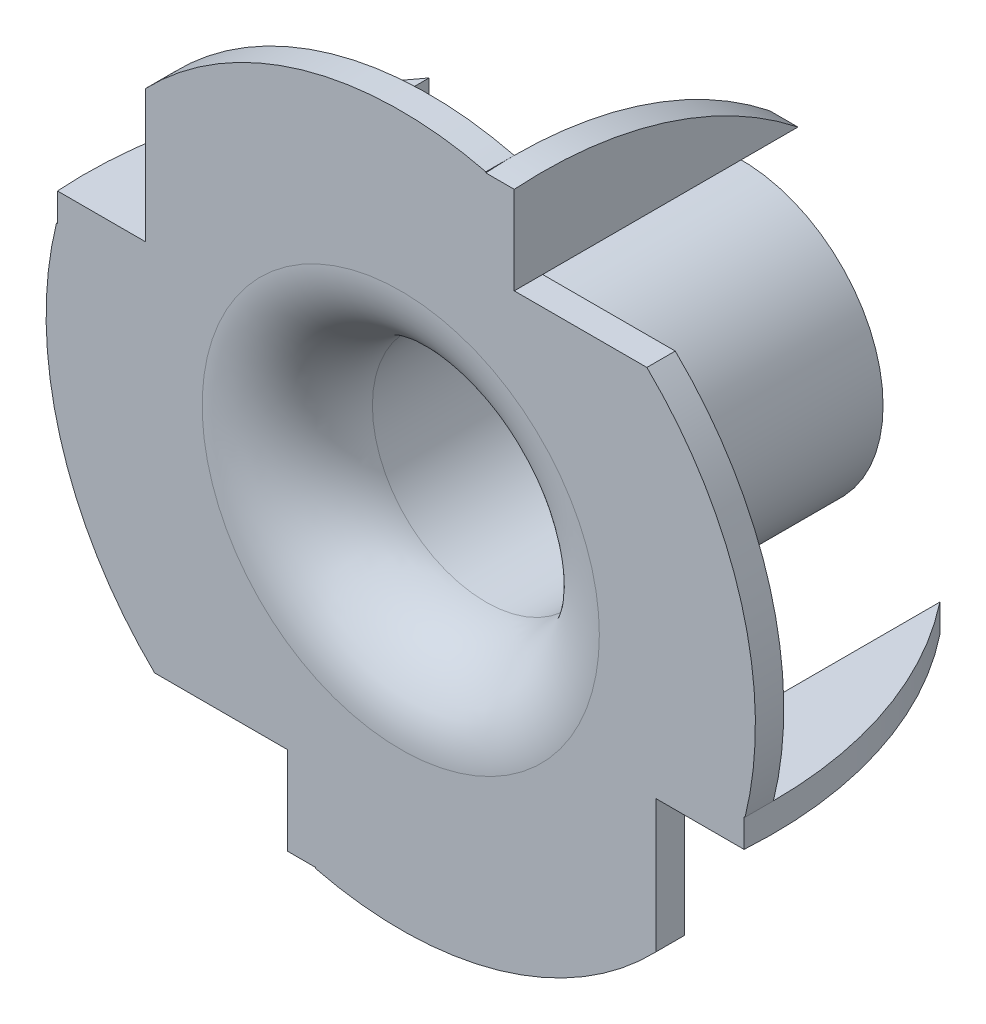
ISO-10303-21;
HEADER;
FILE_DESCRIPTION(('STEP AP214'),'2;1');
FILE_NAME('part.step','',(''),(''),'','','');
FILE_SCHEMA(('AUTOMOTIVE_DESIGN { 1 0 10303 214 1 1 1 1 }'));
ENDSEC;
DATA;
#1=APPLICATION_CONTEXT('core data for automotive mechanical design processes');
#2=APPLICATION_PROTOCOL_DEFINITION('international standard','automotive_design',2000,#1);
#3=PRODUCT_CONTEXT('',#1,'mechanical');
#4=PRODUCT('Part','Part','',(#3));
#5=PRODUCT_RELATED_PRODUCT_CATEGORY('part','',(#4));
#6=PRODUCT_DEFINITION_FORMATION('','',#4);
#7=PRODUCT_DEFINITION_CONTEXT('part definition',#1,'design');
#8=PRODUCT_DEFINITION('design','',#6,#7);
#9=PRODUCT_DEFINITION_SHAPE('','',#8);
#10=(LENGTH_UNIT() NAMED_UNIT(*) SI_UNIT(.MILLI.,.METRE.));
#11=(NAMED_UNIT(*) PLANE_ANGLE_UNIT() SI_UNIT($,.RADIAN.));
#12=(NAMED_UNIT(*) SI_UNIT($,.STERADIAN.) SOLID_ANGLE_UNIT());
#13=UNCERTAINTY_MEASURE_WITH_UNIT(LENGTH_MEASURE(1.E-05),#10,'distance_accuracy_value','');
#14=(GEOMETRIC_REPRESENTATION_CONTEXT(3) GLOBAL_UNCERTAINTY_ASSIGNED_CONTEXT((#13)) GLOBAL_UNIT_ASSIGNED_CONTEXT((#10,
#11,#12)) REPRESENTATION_CONTEXT('',''));
#15=CARTESIAN_POINT('',(0.,0.,0.));
#16=DIRECTION('',(0.,0.,1.));
#17=DIRECTION('',(1.,0.,0.));
#18=AXIS2_PLACEMENT_3D('',#15,#16,#17);
#19=CARTESIAN_POINT('',(15.5,8.99999999999986,0.5));
#20=DIRECTION('',(-1.,0.,0.));
#21=DIRECTION('',(0.,-1.,0.));
#22=AXIS2_PLACEMENT_3D('',#19,#20,#21);
#23=PLANE('',#22);
#24=CARTESIAN_POINT('',(15.5,-2.35272642428521,-0.500000000000002));
#25=DIRECTION('',(1.,0.,0.));
#26=DIRECTION('',(0.,0.,1.));
#27=AXIS2_PLACEMENT_3D('',#24,#25,#26);
#28=CIRCLE('',#27,14.4873875237968);
#29=CARTESIAN_POINT('',(15.4999999999999,12.1346610995116,-0.5));
#30=VERTEX_POINT('',#29);
#31=CARTESIAN_POINT('',(15.4999999999999,12.1001071132833,0.5));
#32=VERTEX_POINT('',#31);
#33=EDGE_CURVE('E420',#30,#32,#28,.T.);
#34=ORIENTED_EDGE('',*,*,#33,.F.);
#35=DIRECTION('',(0.,0.,-1.));
#36=VECTOR('',#35,1.);
#37=CARTESIAN_POINT('',(15.5,12.1346610995115,0.5));
#38=LINE('',#37,#36);
#39=CARTESIAN_POINT('',(15.5,12.1346610995115,0.5));
#40=VERTEX_POINT('',#39);
#41=EDGE_CURVE('E274',#40,#30,#38,.T.);
#42=ORIENTED_EDGE('',*,*,#41,.F.);
#43=DIRECTION('',(0.,1.,0.));
#44=VECTOR('',#43,1.);
#45=CARTESIAN_POINT('',(15.5,8.99999999999986,0.5));
#46=LINE('',#45,#44);
#47=EDGE_CURVE('E309',#32,#40,#46,.T.);
#48=ORIENTED_EDGE('',*,*,#47,.F.);
#49=EDGE_LOOP('',(#34,#42,#48));
#50=FACE_BOUND('',#49,.T.);
#51=ADVANCED_FACE('F42',(#50),#23,.F.);
#52=CARTESIAN_POINT('',(21.4999999999999,-3.00000000000019,0.5));
#53=DIRECTION('',(0.,1.,0.));
#54=DIRECTION('',(-1.,0.,0.));
#55=AXIS2_PLACEMENT_3D('',#52,#53,#54);
#56=PLANE('',#55);
#57=CARTESIAN_POINT('',(10.1472735757148,-3.,-0.500000000000002));
#58=DIRECTION('',(0.,-1.,0.));
#59=DIRECTION('',(0.,0.,1.));
#60=AXIS2_PLACEMENT_3D('',#57,#58,#59);
#61=CIRCLE('',#60,14.4873875237968);
#62=CARTESIAN_POINT('',(24.6346610995116,-3.,-0.5));
#63=VERTEX_POINT('',#62);
#64=CARTESIAN_POINT('',(24.6001071132832,-3.,0.5));
#65=VERTEX_POINT('',#64);
#66=EDGE_CURVE('E214',#63,#65,#61,.T.);
#67=ORIENTED_EDGE('',*,*,#66,.F.);
#68=DIRECTION('',(0.,0.,-1.));
#69=VECTOR('',#68,1.);
#70=CARTESIAN_POINT('',(24.6346610995115,-3.00000000000017,0.5));
#71=LINE('',#70,#69);
#72=CARTESIAN_POINT('',(24.6346610995115,-3.00000000000017,0.5));
#73=VERTEX_POINT('',#72);
#74=EDGE_CURVE('E300',#73,#63,#71,.T.);
#75=ORIENTED_EDGE('',*,*,#74,.F.);
#76=DIRECTION('',(1.,0.,0.));
#77=VECTOR('',#76,1.);
#78=CARTESIAN_POINT('',(21.4999999999999,-3.00000000000019,0.5));
#79=LINE('',#78,#77);
#80=EDGE_CURVE('E299',#65,#73,#79,.T.);
#81=ORIENTED_EDGE('',*,*,#80,.F.);
#82=EDGE_LOOP('',(#67,#75,#81));
#83=FACE_BOUND('',#82,.T.);
#84=ADVANCED_FACE('F425',(#83),#56,.F.);
#85=CARTESIAN_POINT('',(9.49999999999986,-9.0000000000001,0.5));
#86=DIRECTION('',(1.,0.,0.));
#87=DIRECTION('',(0.,1.,0.));
#88=AXIS2_PLACEMENT_3D('',#85,#86,#87);
#89=PLANE('',#88);
#90=CARTESIAN_POINT('',(9.49999999999999,2.35272642428523,-0.500000000000002));
#91=DIRECTION('',(-1.,0.,0.));
#92=DIRECTION('',(0.,0.,1.));
#93=AXIS2_PLACEMENT_3D('',#90,#91,#92);
#94=CIRCLE('',#93,14.4873875237968);
#95=CARTESIAN_POINT('',(9.50000000000004,-12.1346610995116,-0.5));
#96=VERTEX_POINT('',#95);
#97=CARTESIAN_POINT('',(9.50000000000004,-12.1001071132833,0.5));
#98=VERTEX_POINT('',#97);
#99=EDGE_CURVE('E245',#96,#98,#94,.T.);
#100=ORIENTED_EDGE('',*,*,#99,.F.);
#101=DIRECTION('',(0.,0.,-1.));
#102=VECTOR('',#101,1.);
#103=CARTESIAN_POINT('',(9.49999999999987,-12.1346610995117,0.5));
#104=LINE('',#103,#102);
#105=CARTESIAN_POINT('',(9.49999999999987,-12.1346610995117,0.5));
#106=VERTEX_POINT('',#105);
#107=EDGE_CURVE('E290',#106,#96,#104,.T.);
#108=ORIENTED_EDGE('',*,*,#107,.F.);
#109=DIRECTION('',(0.,-1.,0.));
#110=VECTOR('',#109,1.);
#111=CARTESIAN_POINT('',(9.49999999999986,-9.0000000000001,0.5));
#112=LINE('',#111,#110);
#113=EDGE_CURVE('E289',#98,#106,#112,.T.);
#114=ORIENTED_EDGE('',*,*,#113,.F.);
#115=EDGE_LOOP('',(#100,#108,#114));
#116=FACE_BOUND('',#115,.T.);
#117=ADVANCED_FACE('F430',(#116),#89,.F.);
#118=CARTESIAN_POINT('',(3.5,3.,0.5));
#119=DIRECTION('',(0.,-1.,0.));
#120=DIRECTION('',(0.,0.,-1.));
#121=AXIS2_PLACEMENT_3D('',#118,#119,#120);
#122=PLANE('',#121);
#123=CARTESIAN_POINT('',(14.8527264242852,3.,-0.500000000000002));
#124=DIRECTION('',(0.,1.,0.));
#125=DIRECTION('',(0.,0.,1.));
#126=AXIS2_PLACEMENT_3D('',#123,#124,#125);
#127=CIRCLE('',#126,14.4873875237968);
#128=CARTESIAN_POINT('',(0.365338900488402,3.,-0.5));
#129=VERTEX_POINT('',#128);
#130=CARTESIAN_POINT('',(0.399892886716758,3.,0.5));
#131=VERTEX_POINT('',#130);
#132=EDGE_CURVE('E265',#129,#131,#127,.T.);
#133=ORIENTED_EDGE('',*,*,#132,.F.);
#134=DIRECTION('',(0.,0.,-1.));
#135=VECTOR('',#134,1.);
#136=CARTESIAN_POINT('',(0.365338900488402,3.,0.5));
#137=LINE('',#136,#135);
#138=CARTESIAN_POINT('',(0.365338900488402,3.,0.5));
#139=VERTEX_POINT('',#138);
#140=EDGE_CURVE('E282',#139,#129,#137,.T.);
#141=ORIENTED_EDGE('',*,*,#140,.F.);
#142=DIRECTION('',(-1.,0.,0.));
#143=VECTOR('',#142,1.);
#144=CARTESIAN_POINT('',(3.5,3.,0.5));
#145=LINE('',#144,#143);
#146=EDGE_CURVE('E278',#131,#139,#145,.T.);
#147=ORIENTED_EDGE('',*,*,#146,.F.);
#148=EDGE_LOOP('',(#133,#141,#147));
#149=FACE_BOUND('',#148,.T.);
#150=ADVANCED_FACE('F527',(#149),#122,.F.);
#151=CARTESIAN_POINT('',(12.5,0.,0.));
#152=DIRECTION('',(0.,0.,1.));
#153=DIRECTION('',(1.,0.,0.));
#154=AXIS2_PLACEMENT_3D('',#151,#152,#153);
#155=CYLINDRICAL_SURFACE('',#154,12.5);
#156=ORIENTED_EDGE('',*,*,#140,.T.);
#157=CARTESIAN_POINT('',(12.5,0.,-0.5));
#158=DIRECTION('',(0.,0.,1.));
#159=DIRECTION('',(1.,0.,0.));
#160=AXIS2_PLACEMENT_3D('',#157,#158,#159);
#161=CIRCLE('',#160,12.5);
#162=CARTESIAN_POINT('',(3.82532421355138,-9.00000000000012,-0.5));
#163=VERTEX_POINT('',#162);
#164=EDGE_CURVE('E379',#129,#163,#161,.T.);
#165=ORIENTED_EDGE('',*,*,#164,.T.);
#166=DIRECTION('',(0.,0.,-1.));
#167=VECTOR('',#166,1.);
#168=CARTESIAN_POINT('',(3.82532421355112,-9.00000000000012,0.5));
#169=LINE('',#168,#167);
#170=CARTESIAN_POINT('',(3.82532421355112,-9.00000000000012,0.5));
#171=VERTEX_POINT('',#170);
#172=EDGE_CURVE('E287',#171,#163,#169,.T.);
#173=ORIENTED_EDGE('',*,*,#172,.F.);
#174=CARTESIAN_POINT('',(12.5,0.,0.5));
#175=DIRECTION('',(0.,0.,1.));
#176=DIRECTION('',(1.,0.,0.));
#177=AXIS2_PLACEMENT_3D('',#174,#175,#176);
#178=CIRCLE('',#177,12.5);
#179=EDGE_CURVE('E402',#139,#171,#178,.T.);
#180=ORIENTED_EDGE('',*,*,#179,.F.);
#181=EDGE_LOOP('',(#156,#165,#173,#180));
#182=FACE_BOUND('',#181,.T.);
#183=ADVANCED_FACE('F456',(#182),#155,.T.);
#184=ORIENTED_EDGE('',*,*,#107,.T.);
#185=CARTESIAN_POINT('',(21.5,-8.67467578644876,-0.5));
#186=VERTEX_POINT('',#185);
#187=EDGE_CURVE('E337',#96,#186,#161,.T.);
#188=ORIENTED_EDGE('',*,*,#187,.T.);
#189=DIRECTION('',(0.,0.,-1.));
#190=VECTOR('',#189,1.);
#191=CARTESIAN_POINT('',(21.5,-8.67467578644893,0.5));
#192=LINE('',#191,#190);
#193=CARTESIAN_POINT('',(21.5,-8.67467578644893,0.5));
#194=VERTEX_POINT('',#193);
#195=EDGE_CURVE('E297',#194,#186,#192,.T.);
#196=ORIENTED_EDGE('',*,*,#195,.F.);
#197=EDGE_CURVE('E332',#106,#194,#178,.T.);
#198=ORIENTED_EDGE('',*,*,#197,.F.);
#199=EDGE_LOOP('',(#184,#188,#196,#198));
#200=FACE_BOUND('',#199,.T.);
#201=ADVANCED_FACE('F388',(#200),#155,.T.);
#202=ORIENTED_EDGE('',*,*,#74,.T.);
#203=CARTESIAN_POINT('',(21.1746757864488,8.99999999999992,-0.5));
#204=VERTEX_POINT('',#203);
#205=EDGE_CURVE('E334',#63,#204,#161,.T.);
#206=ORIENTED_EDGE('',*,*,#205,.T.);
#207=DIRECTION('',(0.,0.,-1.));
#208=VECTOR('',#207,1.);
#209=CARTESIAN_POINT('',(21.1746757864487,8.99999999999992,0.5));
#210=LINE('',#209,#208);
#211=CARTESIAN_POINT('',(21.1746757864487,8.99999999999992,0.5));
#212=VERTEX_POINT('',#211);
#213=EDGE_CURVE('E307',#212,#204,#210,.T.);
#214=ORIENTED_EDGE('',*,*,#213,.F.);
#215=EDGE_CURVE('E329',#73,#212,#178,.T.);
#216=ORIENTED_EDGE('',*,*,#215,.F.);
#217=EDGE_LOOP('',(#202,#206,#214,#216));
#218=FACE_BOUND('',#217,.T.);
#219=ADVANCED_FACE('F439',(#218),#155,.T.);
#220=CARTESIAN_POINT('',(12.5,0.,0.));
#221=DIRECTION('',(0.,0.,1.));
#222=DIRECTION('',(1.,0.,0.));
#223=AXIS2_PLACEMENT_3D('',#220,#221,#222);
#224=CYLINDRICAL_SURFACE('',#223,5.);
#225=CARTESIAN_POINT('',(12.5,0.,-11.5));
#226=DIRECTION('',(0.,0.,1.));
#227=DIRECTION('',(1.,0.,0.));
#228=AXIS2_PLACEMENT_3D('',#225,#226,#227);
#229=CIRCLE('',#228,5.);
#230=CARTESIAN_POINT('',(17.5,0.,-11.5));
#231=VERTEX_POINT('',#230);
#232=EDGE_CURVE('E317',#231,#231,#229,.T.);
#233=ORIENTED_EDGE('',*,*,#232,.T.);
#234=EDGE_LOOP('',(#233));
#235=FACE_BOUND('',#234,.T.);
#236=CARTESIAN_POINT('',(12.5,0.,-2.5));
#237=DIRECTION('',(0.,0.,1.));
#238=DIRECTION('',(1.,0.,0.));
#239=AXIS2_PLACEMENT_3D('',#236,#237,#238);
#240=CIRCLE('',#239,5.);
#241=CARTESIAN_POINT('',(17.5,0.,-2.5));
#242=VERTEX_POINT('',#241);
#243=EDGE_CURVE('E285',#242,#242,#240,.T.);
#244=ORIENTED_EDGE('',*,*,#243,.F.);
#245=EDGE_LOOP('',(#244));
#246=FACE_BOUND('',#245,.T.);
#247=ADVANCED_FACE('F436',(#235,#246),#224,.T.);
#248=CARTESIAN_POINT('',(12.5,0.,-2.5));
#249=DIRECTION('',(0.,0.,1.));
#250=DIRECTION('',(1.,0.,0.));
#251=AXIS2_PLACEMENT_3D('',#248,#249,#250);
#252=TOROIDAL_SURFACE('',#251,7.,2.);
#253=ORIENTED_EDGE('',*,*,#243,.T.);
#254=EDGE_LOOP('',(#253));
#255=FACE_BOUND('',#254,.T.);
#256=CARTESIAN_POINT('',(12.5,0.,-0.5));
#257=DIRECTION('',(0.,0.,1.));
#258=DIRECTION('',(1.,0.,0.));
#259=AXIS2_PLACEMENT_3D('',#256,#257,#258);
#260=CIRCLE('',#259,7.);
#261=CARTESIAN_POINT('',(19.5,0.,-0.5));
#262=VERTEX_POINT('',#261);
#263=EDGE_CURVE('E339',#262,#262,#260,.T.);
#264=ORIENTED_EDGE('',*,*,#263,.F.);
#265=EDGE_LOOP('',(#264));
#266=FACE_BOUND('',#265,.T.);
#267=ADVANCED_FACE('F44',(#255,#266),#252,.F.);
#268=CARTESIAN_POINT('',(0.,0.,-11.5));
#269=DIRECTION('',(0.,0.,1.));
#270=DIRECTION('',(1.,0.,0.));
#271=AXIS2_PLACEMENT_3D('',#268,#269,#270);
#272=PLANE('',#271);
#273=ORIENTED_EDGE('',*,*,#232,.F.);
#274=EDGE_LOOP('',(#273));
#275=FACE_BOUND('',#274,.T.);
#276=CARTESIAN_POINT('',(12.5,0.,-11.5));
#277=DIRECTION('',(0.,0.,1.));
#278=DIRECTION('',(1.,0.,0.));
#279=AXIS2_PLACEMENT_3D('',#276,#277,#278);
#280=CIRCLE('',#279,4.);
#281=CARTESIAN_POINT('',(16.5,0.,-11.5));
#282=VERTEX_POINT('',#281);
#283=EDGE_CURVE('E320',#282,#282,#280,.T.);
#284=ORIENTED_EDGE('',*,*,#283,.T.);
#285=EDGE_LOOP('',(#284));
#286=FACE_BOUND('',#285,.T.);
#287=ADVANCED_FACE('F441',(#275,#286),#272,.F.);
#288=CARTESIAN_POINT('',(12.5,0.,0.));
#289=DIRECTION('',(0.,0.,1.));
#290=DIRECTION('',(1.,0.,0.));
#291=AXIS2_PLACEMENT_3D('',#288,#289,#290);
#292=CYLINDRICAL_SURFACE('',#291,4.);
#293=CARTESIAN_POINT('',(12.5,0.,-2.5));
#294=DIRECTION('',(0.,0.,1.));
#295=DIRECTION('',(1.,0.,0.));
#296=AXIS2_PLACEMENT_3D('',#293,#294,#295);
#297=CIRCLE('',#296,4.);
#298=CARTESIAN_POINT('',(16.5,0.,-2.5));
#299=VERTEX_POINT('',#298);
#300=EDGE_CURVE('E323',#299,#299,#297,.T.);
#301=ORIENTED_EDGE('',*,*,#300,.T.);
#302=EDGE_LOOP('',(#301));
#303=FACE_BOUND('',#302,.T.);
#304=ORIENTED_EDGE('',*,*,#283,.F.);
#305=EDGE_LOOP('',(#304));
#306=FACE_BOUND('',#305,.T.);
#307=ADVANCED_FACE('F444',(#303,#306),#292,.F.);
#308=CARTESIAN_POINT('',(12.5,0.,-2.5));
#309=DIRECTION('',(0.,0.,1.));
#310=DIRECTION('',(1.,0.,0.));
#311=AXIS2_PLACEMENT_3D('',#308,#309,#310);
#312=TOROIDAL_SURFACE('',#311,7.,3.);
#313=ORIENTED_EDGE('',*,*,#300,.F.);
#314=EDGE_LOOP('',(#313));
#315=FACE_BOUND('',#314,.T.);
#316=CARTESIAN_POINT('',(12.5,0.,0.5));
#317=DIRECTION('',(0.,0.,1.));
#318=DIRECTION('',(1.,0.,0.));
#319=AXIS2_PLACEMENT_3D('',#316,#317,#318);
#320=CIRCLE('',#319,7.);
#321=CARTESIAN_POINT('',(19.5,0.,0.5));
#322=VERTEX_POINT('',#321);
#323=EDGE_CURVE('E326',#322,#322,#320,.T.);
#324=ORIENTED_EDGE('',*,*,#323,.T.);
#325=EDGE_LOOP('',(#324));
#326=FACE_BOUND('',#325,.T.);
#327=ADVANCED_FACE('F448',(#315,#326),#312,.T.);
#328=CARTESIAN_POINT('',(0.,0.,0.5));
#329=DIRECTION('',(0.,0.,-1.));
#330=DIRECTION('',(-1.,0.,0.));
#331=AXIS2_PLACEMENT_3D('',#328,#329,#330);
#332=PLANE('',#331);
#333=DIRECTION('',(-1.,0.,0.));
#334=VECTOR('',#333,1.);
#335=CARTESIAN_POINT('',(16.4999999999999,12.1001071132833,0.5));
#336=LINE('',#335,#334);
#337=CARTESIAN_POINT('',(16.4999999999999,12.1001071132833,0.5));
#338=VERTEX_POINT('',#337);
#339=EDGE_CURVE('E206',#338,#32,#336,.T.);
#340=ORIENTED_EDGE('',*,*,#339,.T.);
#341=ORIENTED_EDGE('',*,*,#47,.T.);
#342=CARTESIAN_POINT('',(3.5,8.67467578644874,0.5));
#343=VERTEX_POINT('',#342);
#344=EDGE_CURVE('E333',#40,#343,#178,.T.);
#345=ORIENTED_EDGE('',*,*,#344,.T.);
#346=DIRECTION('',(0.,-1.,0.));
#347=VECTOR('',#346,1.);
#348=CARTESIAN_POINT('',(3.5,8.67467578644874,0.5));
#349=LINE('',#348,#347);
#350=CARTESIAN_POINT('',(3.5,4.,0.5));
#351=VERTEX_POINT('',#350);
#352=EDGE_CURVE('E275',#343,#351,#349,.T.);
#353=ORIENTED_EDGE('',*,*,#352,.T.);
#354=DIRECTION('',(1.,0.,0.));
#355=VECTOR('',#354,1.);
#356=CARTESIAN_POINT('',(0.,4.,0.5));
#357=LINE('',#356,#355);
#358=CARTESIAN_POINT('',(0.399892886716758,4.,0.5));
#359=VERTEX_POINT('',#358);
#360=EDGE_CURVE('E261',#359,#351,#357,.T.);
#361=ORIENTED_EDGE('',*,*,#360,.F.);
#362=DIRECTION('',(0.,-1.,0.));
#363=VECTOR('',#362,1.);
#364=CARTESIAN_POINT('',(0.399892886716758,4.,0.5));
#365=LINE('',#364,#363);
#366=EDGE_CURVE('E263',#359,#131,#365,.T.);
#367=ORIENTED_EDGE('',*,*,#366,.T.);
#368=ORIENTED_EDGE('',*,*,#146,.T.);
#369=ORIENTED_EDGE('',*,*,#179,.T.);
#370=DIRECTION('',(1.,0.,0.));
#371=VECTOR('',#370,1.);
#372=CARTESIAN_POINT('',(3.82532421355112,-9.00000000000012,0.5));
#373=LINE('',#372,#371);
#374=CARTESIAN_POINT('',(8.50000000000003,-9.0000000000001,0.5));
#375=VERTEX_POINT('',#374);
#376=EDGE_CURVE('E279',#171,#375,#373,.T.);
#377=ORIENTED_EDGE('',*,*,#376,.T.);
#378=DIRECTION('',(0.,1.,0.));
#379=VECTOR('',#378,1.);
#380=CARTESIAN_POINT('',(8.50000000000004,-12.5,0.5));
#381=LINE('',#380,#379);
#382=CARTESIAN_POINT('',(8.50000000000004,-12.1001071132833,0.5));
#383=VERTEX_POINT('',#382);
#384=EDGE_CURVE('E241',#383,#375,#381,.T.);
#385=ORIENTED_EDGE('',*,*,#384,.F.);
#386=DIRECTION('',(1.,0.,0.));
#387=VECTOR('',#386,1.);
#388=CARTESIAN_POINT('',(8.50000000000004,-12.1001071132833,0.5));
#389=LINE('',#388,#387);
#390=EDGE_CURVE('E243',#383,#98,#389,.T.);
#391=ORIENTED_EDGE('',*,*,#390,.T.);
#392=ORIENTED_EDGE('',*,*,#113,.T.);
#393=ORIENTED_EDGE('',*,*,#197,.T.);
#394=DIRECTION('',(0.,1.,0.));
#395=VECTOR('',#394,1.);
#396=CARTESIAN_POINT('',(21.5,-8.67467578644893,0.5));
#397=LINE('',#396,#395);
#398=CARTESIAN_POINT('',(21.4999999999999,-4.,0.5));
#399=VERTEX_POINT('',#398);
#400=EDGE_CURVE('E293',#194,#399,#397,.T.);
#401=ORIENTED_EDGE('',*,*,#400,.T.);
#402=DIRECTION('',(-1.,0.,0.));
#403=VECTOR('',#402,1.);
#404=CARTESIAN_POINT('',(25.,-4.,0.5));
#405=LINE('',#404,#403);
#406=CARTESIAN_POINT('',(24.6001071132832,-4.,0.5));
#407=VERTEX_POINT('',#406);
#408=EDGE_CURVE('E65',#407,#399,#405,.T.);
#409=ORIENTED_EDGE('',*,*,#408,.F.);
#410=DIRECTION('',(0.,1.,0.));
#411=VECTOR('',#410,1.);
#412=CARTESIAN_POINT('',(24.6001071132832,-4.,0.5));
#413=LINE('',#412,#411);
#414=EDGE_CURVE('E224',#407,#65,#413,.T.);
#415=ORIENTED_EDGE('',*,*,#414,.T.);
#416=ORIENTED_EDGE('',*,*,#80,.T.);
#417=ORIENTED_EDGE('',*,*,#215,.T.);
#418=DIRECTION('',(-1.,0.,0.));
#419=VECTOR('',#418,1.);
#420=CARTESIAN_POINT('',(21.1746757864487,8.99999999999992,0.5));
#421=LINE('',#420,#419);
#422=CARTESIAN_POINT('',(16.4999999999999,8.99999999999987,0.5));
#423=VERTEX_POINT('',#422);
#424=EDGE_CURVE('E303',#212,#423,#421,.T.);
#425=ORIENTED_EDGE('',*,*,#424,.T.);
#426=DIRECTION('',(0.,-1.,0.));
#427=VECTOR('',#426,1.);
#428=CARTESIAN_POINT('',(16.4999999999999,12.5,0.5));
#429=LINE('',#428,#427);
#430=EDGE_CURVE('E57',#338,#423,#429,.T.);
#431=ORIENTED_EDGE('',*,*,#430,.F.);
#432=EDGE_LOOP('',(#340,#341,#345,#353,#361,#367,#368,#369,#377,#385,#391,#392,#393,#401,#409,
#415,#416,#417,#425,#431));
#433=FACE_BOUND('',#432,.T.);
#434=ORIENTED_EDGE('',*,*,#323,.F.);
#435=EDGE_LOOP('',(#434));
#436=FACE_BOUND('',#435,.T.);
#437=ADVANCED_FACE('F399',(#433,#436),#332,.F.);
#438=DIRECTION('',(0.,0.,-1.));
#439=VECTOR('',#438,1.);
#440=CARTESIAN_POINT('',(3.5,8.67467578644874,0.5));
#441=LINE('',#440,#439);
#442=CARTESIAN_POINT('',(3.5,8.67467578644874,-0.5));
#443=VERTEX_POINT('',#442);
#444=EDGE_CURVE('E281',#343,#443,#441,.T.);
#445=ORIENTED_EDGE('',*,*,#444,.F.);
#446=ORIENTED_EDGE('',*,*,#344,.F.);
#447=ORIENTED_EDGE('',*,*,#41,.T.);
#448=EDGE_CURVE('E338',#30,#443,#161,.T.);
#449=ORIENTED_EDGE('',*,*,#448,.T.);
#450=EDGE_LOOP('',(#445,#446,#447,#449));
#451=FACE_BOUND('',#450,.T.);
#452=ADVANCED_FACE('F412',(#451),#155,.T.);
#453=CARTESIAN_POINT('',(0.,0.,-0.5));
#454=DIRECTION('',(0.,0.,-1.));
#455=DIRECTION('',(-1.,0.,0.));
#456=AXIS2_PLACEMENT_3D('',#453,#454,#455);
#457=PLANE('',#456);
#458=DIRECTION('',(-1.,0.,0.));
#459=VECTOR('',#458,1.);
#460=CARTESIAN_POINT('',(0.,3.,-0.5));
#461=LINE('',#460,#459);
#462=CARTESIAN_POINT('',(3.5,3.,-0.5));
#463=VERTEX_POINT('',#462);
#464=EDGE_CURVE('E11',#463,#129,#461,.T.);
#465=ORIENTED_EDGE('',*,*,#464,.F.);
#466=DIRECTION('',(0.,-1.,0.));
#467=VECTOR('',#466,1.);
#468=CARTESIAN_POINT('',(3.5,0.,-0.5));
#469=LINE('',#468,#467);
#470=CARTESIAN_POINT('',(3.5,4.,-0.5));
#471=VERTEX_POINT('',#470);
#472=EDGE_CURVE('E359',#471,#463,#469,.T.);
#473=ORIENTED_EDGE('',*,*,#472,.F.);
#474=EDGE_CURVE('E50',#443,#471,#469,.T.);
#475=ORIENTED_EDGE('',*,*,#474,.F.);
#476=ORIENTED_EDGE('',*,*,#448,.F.);
#477=DIRECTION('',(0.,1.,0.));
#478=VECTOR('',#477,1.);
#479=CARTESIAN_POINT('',(15.5000000000001,1.62976490107582E-13,-0.5));
#480=LINE('',#479,#478);
#481=CARTESIAN_POINT('',(15.4999999999999,9.00000000000003,-0.5));
#482=VERTEX_POINT('',#481);
#483=EDGE_CURVE('E346',#482,#30,#480,.T.);
#484=ORIENTED_EDGE('',*,*,#483,.F.);
#485=DIRECTION('',(-1.,0.,0.));
#486=VECTOR('',#485,1.);
#487=CARTESIAN_POINT('',(0.,8.9999999999997,-0.5));
#488=LINE('',#487,#486);
#489=CARTESIAN_POINT('',(16.4999999999999,9.00000000000004,-0.5));
#490=VERTEX_POINT('',#489);
#491=EDGE_CURVE('E342',#490,#482,#488,.T.);
#492=ORIENTED_EDGE('',*,*,#491,.F.);
#493=EDGE_CURVE('E343',#204,#490,#488,.T.);
#494=ORIENTED_EDGE('',*,*,#493,.F.);
#495=ORIENTED_EDGE('',*,*,#205,.F.);
#496=DIRECTION('',(1.,0.,0.));
#497=VECTOR('',#496,1.);
#498=CARTESIAN_POINT('',(0.,-3.00000000000034,-0.5));
#499=LINE('',#498,#497);
#500=CARTESIAN_POINT('',(21.5,-3.,-0.5));
#501=VERTEX_POINT('',#500);
#502=EDGE_CURVE('E352',#501,#63,#499,.T.);
#503=ORIENTED_EDGE('',*,*,#502,.F.);
#504=DIRECTION('',(0.,1.,0.));
#505=VECTOR('',#504,1.);
#506=CARTESIAN_POINT('',(21.4999999999999,1.44594023520508E-13,-0.5));
#507=LINE('',#506,#505);
#508=CARTESIAN_POINT('',(21.5,-4.,-0.5));
#509=VERTEX_POINT('',#508);
#510=EDGE_CURVE('E348',#509,#501,#507,.T.);
#511=ORIENTED_EDGE('',*,*,#510,.F.);
#512=EDGE_CURVE('E349',#186,#509,#507,.T.);
#513=ORIENTED_EDGE('',*,*,#512,.F.);
#514=ORIENTED_EDGE('',*,*,#187,.F.);
#515=DIRECTION('',(0.,-1.,0.));
#516=VECTOR('',#515,1.);
#517=CARTESIAN_POINT('',(9.49999999999983,0.,-0.5));
#518=LINE('',#517,#516);
#519=CARTESIAN_POINT('',(9.50000000000003,-9.00000000000001,-0.5));
#520=VERTEX_POINT('',#519);
#521=EDGE_CURVE('E358',#520,#96,#518,.T.);
#522=ORIENTED_EDGE('',*,*,#521,.F.);
#523=DIRECTION('',(1.,0.,0.));
#524=VECTOR('',#523,1.);
#525=CARTESIAN_POINT('',(0.,-9.00000000000013,-0.5));
#526=LINE('',#525,#524);
#527=CARTESIAN_POINT('',(8.50000000000003,-9.00000000000001,-0.5));
#528=VERTEX_POINT('',#527);
#529=EDGE_CURVE('E354',#528,#520,#526,.T.);
#530=ORIENTED_EDGE('',*,*,#529,.F.);
#531=EDGE_CURVE('E355',#163,#528,#526,.T.);
#532=ORIENTED_EDGE('',*,*,#531,.F.);
#533=ORIENTED_EDGE('',*,*,#164,.F.);
#534=EDGE_LOOP('',(#465,#473,#475,#476,#484,#492,#494,#495,#503,#511,#513,#514,#522,#530,#532,#533));
#535=FACE_BOUND('',#534,.T.);
#536=ORIENTED_EDGE('',*,*,#263,.T.);
#537=EDGE_LOOP('',(#536));
#538=FACE_BOUND('',#537,.T.);
#539=ADVANCED_FACE('F375',(#535,#538),#457,.T.);
#540=CARTESIAN_POINT('',(21.1746757864487,8.99999999999992,0.5));
#541=DIRECTION('',(0.,-1.,0.));
#542=DIRECTION('',(1.,0.,0.));
#543=AXIS2_PLACEMENT_3D('',#540,#541,#542);
#544=PLANE('',#543);
#545=ORIENTED_EDGE('',*,*,#493,.T.);
#546=DIRECTION('',(0.,0.,-1.));
#547=VECTOR('',#546,1.);
#548=CARTESIAN_POINT('',(16.4999999999999,9.00000000000004,0.));
#549=LINE('',#548,#547);
#550=EDGE_CURVE('E194',#423,#490,#549,.T.);
#551=ORIENTED_EDGE('',*,*,#550,.F.);
#552=ORIENTED_EDGE('',*,*,#424,.F.);
#553=ORIENTED_EDGE('',*,*,#213,.T.);
#554=EDGE_LOOP('',(#545,#551,#552,#553));
#555=FACE_BOUND('',#554,.T.);
#556=ADVANCED_FACE('F435',(#555),#544,.F.);
#557=CARTESIAN_POINT('',(21.5,-8.67467578644893,0.5));
#558=DIRECTION('',(-1.,0.,0.));
#559=DIRECTION('',(0.,-1.,0.));
#560=AXIS2_PLACEMENT_3D('',#557,#558,#559);
#561=PLANE('',#560);
#562=ORIENTED_EDGE('',*,*,#512,.T.);
#563=DIRECTION('',(0.,0.,-1.));
#564=VECTOR('',#563,1.);
#565=CARTESIAN_POINT('',(21.5,-4.,0.));
#566=LINE('',#565,#564);
#567=EDGE_CURVE('E219',#399,#509,#566,.T.);
#568=ORIENTED_EDGE('',*,*,#567,.F.);
#569=ORIENTED_EDGE('',*,*,#400,.F.);
#570=ORIENTED_EDGE('',*,*,#195,.T.);
#571=EDGE_LOOP('',(#562,#568,#569,#570));
#572=FACE_BOUND('',#571,.T.);
#573=ADVANCED_FACE('F397',(#572),#561,.F.);
#574=CARTESIAN_POINT('',(3.82532421355112,-9.00000000000012,0.5));
#575=DIRECTION('',(0.,1.,0.));
#576=DIRECTION('',(-1.,0.,0.));
#577=AXIS2_PLACEMENT_3D('',#574,#575,#576);
#578=PLANE('',#577);
#579=ORIENTED_EDGE('',*,*,#531,.T.);
#580=DIRECTION('',(0.,0.,-1.));
#581=VECTOR('',#580,1.);
#582=CARTESIAN_POINT('',(8.50000000000003,-9.00000000000001,0.));
#583=LINE('',#582,#581);
#584=EDGE_CURVE('E235',#375,#528,#583,.T.);
#585=ORIENTED_EDGE('',*,*,#584,.F.);
#586=ORIENTED_EDGE('',*,*,#376,.F.);
#587=ORIENTED_EDGE('',*,*,#172,.T.);
#588=EDGE_LOOP('',(#579,#585,#586,#587));
#589=FACE_BOUND('',#588,.T.);
#590=ADVANCED_FACE('F465',(#589),#578,.F.);
#591=CARTESIAN_POINT('',(3.5,8.67467578644874,0.5));
#592=DIRECTION('',(1.,0.,0.));
#593=DIRECTION('',(0.,1.,0.));
#594=AXIS2_PLACEMENT_3D('',#591,#592,#593);
#595=PLANE('',#594);
#596=ORIENTED_EDGE('',*,*,#474,.T.);
#597=DIRECTION('',(0.,0.,-1.));
#598=VECTOR('',#597,1.);
#599=CARTESIAN_POINT('',(3.5,4.,0.));
#600=LINE('',#599,#598);
#601=EDGE_CURVE('E255',#351,#471,#600,.T.);
#602=ORIENTED_EDGE('',*,*,#601,.F.);
#603=ORIENTED_EDGE('',*,*,#352,.F.);
#604=ORIENTED_EDGE('',*,*,#444,.T.);
#605=EDGE_LOOP('',(#596,#602,#603,#604));
#606=FACE_BOUND('',#605,.T.);
#607=ADVANCED_FACE('F414',(#606),#595,.F.);
#608=CARTESIAN_POINT('',(3.5,4.,0.));
#609=DIRECTION('',(-1.,0.,0.));
#610=DIRECTION('',(0.,0.,1.));
#611=AXIS2_PLACEMENT_3D('',#608,#609,#610);
#612=PLANE('',#611);
#613=ORIENTED_EDGE('',*,*,#472,.T.);
#614=DIRECTION('',(0.,0.,-1.));
#615=VECTOR('',#614,1.);
#616=CARTESIAN_POINT('',(3.5,3.,0.));
#617=LINE('',#616,#615);
#618=CARTESIAN_POINT('',(3.5,3.,-9.5));
#619=VERTEX_POINT('',#618);
#620=EDGE_CURVE('E254',#463,#619,#617,.T.);
#621=ORIENTED_EDGE('',*,*,#620,.T.);
#622=DIRECTION('',(0.,-1.,0.));
#623=VECTOR('',#622,1.);
#624=CARTESIAN_POINT('',(3.5,4.,-9.5));
#625=LINE('',#624,#623);
#626=CARTESIAN_POINT('',(3.5,4.,-9.5));
#627=VERTEX_POINT('',#626);
#628=EDGE_CURVE('E271',#627,#619,#625,.T.);
#629=ORIENTED_EDGE('',*,*,#628,.F.);
#630=EDGE_CURVE('E259',#471,#627,#600,.T.);
#631=ORIENTED_EDGE('',*,*,#630,.F.);
#632=EDGE_LOOP('',(#613,#621,#629,#631));
#633=FACE_BOUND('',#632,.T.);
#634=ADVANCED_FACE('F367',(#633),#612,.F.);
#635=CARTESIAN_POINT('',(14.8527264242852,4.,-0.500000000000002));
#636=DIRECTION('',(0.,-1.,0.));
#637=DIRECTION('',(0.,0.,-1.));
#638=AXIS2_PLACEMENT_3D('',#635,#636,#637);
#639=CYLINDRICAL_SURFACE('',#638,14.4873875237968);
#640=EDGE_CURVE('E266',#619,#129,#127,.T.);
#641=ORIENTED_EDGE('',*,*,#640,.T.);
#642=ORIENTED_EDGE('',*,*,#132,.T.);
#643=ORIENTED_EDGE('',*,*,#366,.F.);
#644=CARTESIAN_POINT('',(14.8527264242852,4.,-0.500000000000002));
#645=DIRECTION('',(0.,1.,0.));
#646=DIRECTION('',(0.,0.,1.));
#647=AXIS2_PLACEMENT_3D('',#644,#645,#646);
#648=CIRCLE('',#647,14.4873875237968);
#649=EDGE_CURVE('E258',#627,#359,#648,.T.);
#650=ORIENTED_EDGE('',*,*,#649,.F.);
#651=ORIENTED_EDGE('',*,*,#628,.T.);
#652=EDGE_LOOP('',(#641,#642,#643,#650,#651));
#653=FACE_BOUND('',#652,.T.);
#654=ADVANCED_FACE('F518',(#653),#639,.T.);
#655=CARTESIAN_POINT('',(0.,4.,0.));
#656=DIRECTION('',(0.,1.,0.));
#657=DIRECTION('',(0.,0.,1.));
#658=AXIS2_PLACEMENT_3D('',#655,#656,#657);
#659=PLANE('',#658);
#660=ORIENTED_EDGE('',*,*,#601,.T.);
#661=ORIENTED_EDGE('',*,*,#630,.T.);
#662=ORIENTED_EDGE('',*,*,#649,.T.);
#663=ORIENTED_EDGE('',*,*,#360,.T.);
#664=EDGE_LOOP('',(#660,#661,#662,#663));
#665=FACE_BOUND('',#664,.T.);
#666=ADVANCED_FACE('F515',(#665),#659,.T.);
#667=CARTESIAN_POINT('',(0.,3.,0.));
#668=DIRECTION('',(0.,1.,0.));
#669=DIRECTION('',(0.,0.,1.));
#670=AXIS2_PLACEMENT_3D('',#667,#668,#669);
#671=PLANE('',#670);
#672=ORIENTED_EDGE('',*,*,#464,.T.);
#673=ORIENTED_EDGE('',*,*,#640,.F.);
#674=ORIENTED_EDGE('',*,*,#620,.F.);
#675=EDGE_LOOP('',(#672,#673,#674));
#676=FACE_BOUND('',#675,.T.);
#677=ADVANCED_FACE('F373',(#676),#671,.F.);
#678=CARTESIAN_POINT('',(8.50000000000003,-9.00000000000001,0.));
#679=DIRECTION('',(0.,-1.,0.));
#680=DIRECTION('',(1.,0.,0.));
#681=AXIS2_PLACEMENT_3D('',#678,#679,#680);
#682=PLANE('',#681);
#683=ORIENTED_EDGE('',*,*,#529,.T.);
#684=DIRECTION('',(0.,0.,-1.));
#685=VECTOR('',#684,1.);
#686=CARTESIAN_POINT('',(9.50000000000003,-9.00000000000001,0.));
#687=LINE('',#686,#685);
#688=CARTESIAN_POINT('',(9.50000000000003,-9.00000000000001,-9.5));
#689=VERTEX_POINT('',#688);
#690=EDGE_CURVE('E234',#520,#689,#687,.T.);
#691=ORIENTED_EDGE('',*,*,#690,.T.);
#692=DIRECTION('',(1.,0.,0.));
#693=VECTOR('',#692,1.);
#694=CARTESIAN_POINT('',(8.50000000000003,-9.00000000000001,-9.5));
#695=LINE('',#694,#693);
#696=CARTESIAN_POINT('',(8.50000000000003,-9.00000000000001,-9.5));
#697=VERTEX_POINT('',#696);
#698=EDGE_CURVE('E251',#697,#689,#695,.T.);
#699=ORIENTED_EDGE('',*,*,#698,.F.);
#700=EDGE_CURVE('E239',#528,#697,#583,.T.);
#701=ORIENTED_EDGE('',*,*,#700,.F.);
#702=EDGE_LOOP('',(#683,#691,#699,#701));
#703=FACE_BOUND('',#702,.T.);
#704=ADVANCED_FACE('F510',(#703),#682,.F.);
#705=CARTESIAN_POINT('',(8.49999999999999,2.35272642428523,-0.500000000000002));
#706=DIRECTION('',(1.,0.,0.));
#707=DIRECTION('',(0.,1.,0.));
#708=AXIS2_PLACEMENT_3D('',#705,#706,#707);
#709=CYLINDRICAL_SURFACE('',#708,14.4873875237968);
#710=EDGE_CURVE('E246',#689,#96,#94,.T.);
#711=ORIENTED_EDGE('',*,*,#710,.T.);
#712=ORIENTED_EDGE('',*,*,#99,.T.);
#713=ORIENTED_EDGE('',*,*,#390,.F.);
#714=CARTESIAN_POINT('',(8.49999999999999,2.35272642428523,-0.500000000000002));
#715=DIRECTION('',(-1.,0.,0.));
#716=DIRECTION('',(0.,0.,1.));
#717=AXIS2_PLACEMENT_3D('',#714,#715,#716);
#718=CIRCLE('',#717,14.4873875237968);
#719=EDGE_CURVE('E238',#697,#383,#718,.T.);
#720=ORIENTED_EDGE('',*,*,#719,.F.);
#721=ORIENTED_EDGE('',*,*,#698,.T.);
#722=EDGE_LOOP('',(#711,#712,#713,#720,#721));
#723=FACE_BOUND('',#722,.T.);
#724=ADVANCED_FACE('F503',(#723),#709,.T.);
#725=CARTESIAN_POINT('',(8.50000000000004,-12.5,0.));
#726=DIRECTION('',(-1.,0.,0.));
#727=DIRECTION('',(0.,0.,1.));
#728=AXIS2_PLACEMENT_3D('',#725,#726,#727);
#729=PLANE('',#728);
#730=ORIENTED_EDGE('',*,*,#584,.T.);
#731=ORIENTED_EDGE('',*,*,#700,.T.);
#732=ORIENTED_EDGE('',*,*,#719,.T.);
#733=ORIENTED_EDGE('',*,*,#384,.T.);
#734=EDGE_LOOP('',(#730,#731,#732,#733));
#735=FACE_BOUND('',#734,.T.);
#736=ADVANCED_FACE('F500',(#735),#729,.T.);
#737=CARTESIAN_POINT('',(9.50000000000004,-12.5,0.));
#738=DIRECTION('',(-1.,0.,0.));
#739=DIRECTION('',(0.,0.,1.));
#740=AXIS2_PLACEMENT_3D('',#737,#738,#739);
#741=PLANE('',#740);
#742=ORIENTED_EDGE('',*,*,#521,.T.);
#743=ORIENTED_EDGE('',*,*,#710,.F.);
#744=ORIENTED_EDGE('',*,*,#690,.F.);
#745=EDGE_LOOP('',(#742,#743,#744));
#746=FACE_BOUND('',#745,.T.);
#747=ADVANCED_FACE('F499',(#746),#741,.F.);
#748=CARTESIAN_POINT('',(21.5,-4.,0.));
#749=DIRECTION('',(1.,0.,0.));
#750=DIRECTION('',(0.,0.,-1.));
#751=AXIS2_PLACEMENT_3D('',#748,#749,#750);
#752=PLANE('',#751);
#753=ORIENTED_EDGE('',*,*,#510,.T.);
#754=DIRECTION('',(0.,0.,-1.));
#755=VECTOR('',#754,1.);
#756=CARTESIAN_POINT('',(21.5,-3.,0.));
#757=LINE('',#756,#755);
#758=CARTESIAN_POINT('',(21.5,-3.,-9.5));
#759=VERTEX_POINT('',#758);
#760=EDGE_CURVE('E212',#501,#759,#757,.T.);
#761=ORIENTED_EDGE('',*,*,#760,.T.);
#762=DIRECTION('',(0.,1.,0.));
#763=VECTOR('',#762,1.);
#764=CARTESIAN_POINT('',(21.5,-4.,-9.5));
#765=LINE('',#764,#763);
#766=CARTESIAN_POINT('',(21.5,-4.,-9.5));
#767=VERTEX_POINT('',#766);
#768=EDGE_CURVE('E231',#767,#759,#765,.T.);
#769=ORIENTED_EDGE('',*,*,#768,.F.);
#770=EDGE_CURVE('E222',#509,#767,#566,.T.);
#771=ORIENTED_EDGE('',*,*,#770,.F.);
#772=EDGE_LOOP('',(#753,#761,#769,#771));
#773=FACE_BOUND('',#772,.T.);
#774=ADVANCED_FACE('F484',(#773),#752,.F.);
#775=CARTESIAN_POINT('',(10.1472735757148,-4.,-0.500000000000002));
#776=DIRECTION('',(0.,1.,0.));
#777=DIRECTION('',(0.,0.,1.));
#778=AXIS2_PLACEMENT_3D('',#775,#776,#777);
#779=CYLINDRICAL_SURFACE('',#778,14.4873875237968);
#780=EDGE_CURVE('E226',#759,#63,#61,.T.);
#781=ORIENTED_EDGE('',*,*,#780,.T.);
#782=ORIENTED_EDGE('',*,*,#66,.T.);
#783=ORIENTED_EDGE('',*,*,#414,.F.);
#784=CARTESIAN_POINT('',(10.1472735757148,-4.,-0.500000000000002));
#785=DIRECTION('',(0.,-1.,0.));
#786=DIRECTION('',(0.,0.,1.));
#787=AXIS2_PLACEMENT_3D('',#784,#785,#786);
#788=CIRCLE('',#787,14.4873875237968);
#789=EDGE_CURVE('E221',#767,#407,#788,.T.);
#790=ORIENTED_EDGE('',*,*,#789,.F.);
#791=ORIENTED_EDGE('',*,*,#768,.T.);
#792=EDGE_LOOP('',(#781,#782,#783,#790,#791));
#793=FACE_BOUND('',#792,.T.);
#794=ADVANCED_FACE('F476',(#793),#779,.T.);
#795=CARTESIAN_POINT('',(25.,-4.,0.));
#796=DIRECTION('',(0.,-1.,0.));
#797=DIRECTION('',(0.,0.,1.));
#798=AXIS2_PLACEMENT_3D('',#795,#796,#797);
#799=PLANE('',#798);
#800=ORIENTED_EDGE('',*,*,#567,.T.);
#801=ORIENTED_EDGE('',*,*,#770,.T.);
#802=ORIENTED_EDGE('',*,*,#789,.T.);
#803=ORIENTED_EDGE('',*,*,#408,.T.);
#804=EDGE_LOOP('',(#800,#801,#802,#803));
#805=FACE_BOUND('',#804,.T.);
#806=ADVANCED_FACE('F485',(#805),#799,.T.);
#807=CARTESIAN_POINT('',(25.,-3.,0.));
#808=DIRECTION('',(0.,-1.,0.));
#809=DIRECTION('',(0.,0.,1.));
#810=AXIS2_PLACEMENT_3D('',#807,#808,#809);
#811=PLANE('',#810);
#812=ORIENTED_EDGE('',*,*,#502,.T.);
#813=ORIENTED_EDGE('',*,*,#780,.F.);
#814=ORIENTED_EDGE('',*,*,#760,.F.);
#815=EDGE_LOOP('',(#812,#813,#814));
#816=FACE_BOUND('',#815,.T.);
#817=ADVANCED_FACE('F482',(#816),#811,.F.);
#818=CARTESIAN_POINT('',(16.4999999999999,9.00000000000004,0.));
#819=DIRECTION('',(0.,1.,0.));
#820=DIRECTION('',(-1.,0.,0.));
#821=AXIS2_PLACEMENT_3D('',#818,#819,#820);
#822=PLANE('',#821);
#823=ORIENTED_EDGE('',*,*,#491,.T.);
#824=DIRECTION('',(0.,0.,-1.));
#825=VECTOR('',#824,1.);
#826=CARTESIAN_POINT('',(15.4999999999999,9.00000000000003,0.));
#827=LINE('',#826,#825);
#828=CARTESIAN_POINT('',(15.4999999999999,9.00000000000003,-9.5));
#829=VERTEX_POINT('',#828);
#830=EDGE_CURVE('E210',#482,#829,#827,.T.);
#831=ORIENTED_EDGE('',*,*,#830,.T.);
#832=DIRECTION('',(-1.,0.,0.));
#833=VECTOR('',#832,1.);
#834=CARTESIAN_POINT('',(16.4999999999999,9.00000000000004,-9.5));
#835=LINE('',#834,#833);
#836=CARTESIAN_POINT('',(16.4999999999999,9.00000000000004,-9.5));
#837=VERTEX_POINT('',#836);
#838=EDGE_CURVE('E204',#837,#829,#835,.T.);
#839=ORIENTED_EDGE('',*,*,#838,.F.);
#840=EDGE_CURVE('E189',#490,#837,#549,.T.);
#841=ORIENTED_EDGE('',*,*,#840,.F.);
#842=EDGE_LOOP('',(#823,#831,#839,#841));
#843=FACE_BOUND('',#842,.T.);
#844=ADVANCED_FACE('F208',(#843),#822,.F.);
#845=CARTESIAN_POINT('',(16.5,-2.3527264242852,-0.500000000000002));
#846=DIRECTION('',(-1.,0.,0.));
#847=DIRECTION('',(0.,-1.,0.));
#848=AXIS2_PLACEMENT_3D('',#845,#846,#847);
#849=CYLINDRICAL_SURFACE('',#848,14.4873875237968);
#850=EDGE_CURVE('E198',#829,#30,#28,.T.);
#851=ORIENTED_EDGE('',*,*,#850,.T.);
#852=ORIENTED_EDGE('',*,*,#33,.T.);
#853=ORIENTED_EDGE('',*,*,#339,.F.);
#854=CARTESIAN_POINT('',(16.5,-2.3527264242852,-0.500000000000002));
#855=DIRECTION('',(1.,0.,0.));
#856=DIRECTION('',(0.,0.,1.));
#857=AXIS2_PLACEMENT_3D('',#854,#855,#856);
#858=CIRCLE('',#857,14.4873875237968);
#859=EDGE_CURVE('E192',#837,#338,#858,.T.);
#860=ORIENTED_EDGE('',*,*,#859,.F.);
#861=ORIENTED_EDGE('',*,*,#838,.T.);
#862=EDGE_LOOP('',(#851,#852,#853,#860,#861));
#863=FACE_BOUND('',#862,.T.);
#864=ADVANCED_FACE('F203',(#863),#849,.T.);
#865=CARTESIAN_POINT('',(16.4999999999999,12.5,0.));
#866=DIRECTION('',(1.,0.,0.));
#867=DIRECTION('',(0.,0.,1.));
#868=AXIS2_PLACEMENT_3D('',#865,#866,#867);
#869=PLANE('',#868);
#870=ORIENTED_EDGE('',*,*,#550,.T.);
#871=ORIENTED_EDGE('',*,*,#840,.T.);
#872=ORIENTED_EDGE('',*,*,#859,.T.);
#873=ORIENTED_EDGE('',*,*,#430,.T.);
#874=EDGE_LOOP('',(#870,#871,#872,#873));
#875=FACE_BOUND('',#874,.T.);
#876=ADVANCED_FACE('F191',(#875),#869,.T.);
#877=CARTESIAN_POINT('',(15.4999999999999,12.5,0.));
#878=DIRECTION('',(1.,0.,0.));
#879=DIRECTION('',(0.,0.,1.));
#880=AXIS2_PLACEMENT_3D('',#877,#878,#879);
#881=PLANE('',#880);
#882=ORIENTED_EDGE('',*,*,#483,.T.);
#883=ORIENTED_EDGE('',*,*,#850,.F.);
#884=ORIENTED_EDGE('',*,*,#830,.F.);
#885=EDGE_LOOP('',(#882,#883,#884));
#886=FACE_BOUND('',#885,.T.);
#887=ADVANCED_FACE('F418',(#886),#881,.F.);
#888=CLOSED_SHELL('',(#51,#84,#117,#150,#183,#201,#219,#247,#267,#287,#307,#327,#437,#452,#539,
#556,#573,#590,#607,#634,#654,#666,#677,#704,#724,#736,#747,#774,#794,#806,#817,#844,#864,#876,#887));
#889=MANIFOLD_SOLID_BREP('B2',#888);
#890=ADVANCED_BREP_SHAPE_REPRESENTATION('',(#18,#889),#14);
#891=SHAPE_DEFINITION_REPRESENTATION(#9,#890);
ENDSEC;
END-ISO-10303-21;
